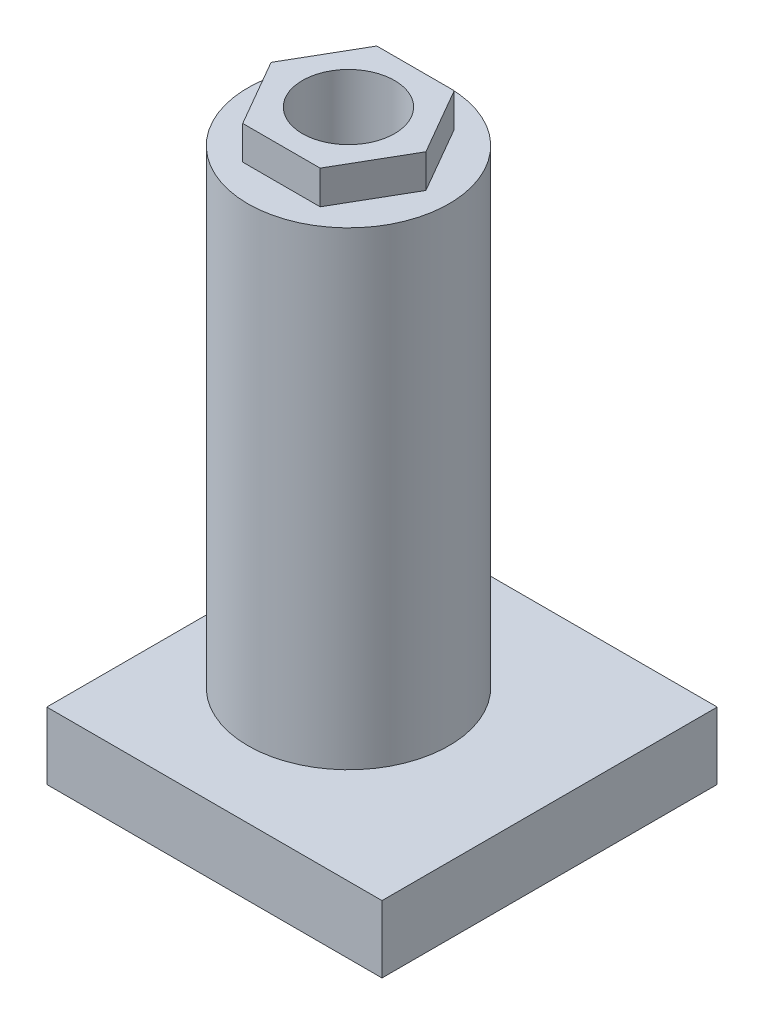
ISO-10303-21;
HEADER;
FILE_DESCRIPTION(('STEP AP214'),'2;1');
FILE_NAME('part.step','',(''),(''),'','','');
FILE_SCHEMA(('AUTOMOTIVE_DESIGN { 1 0 10303 214 1 1 1 1 }'));
ENDSEC;
DATA;
#1=APPLICATION_CONTEXT('core data for automotive mechanical design processes');
#2=APPLICATION_PROTOCOL_DEFINITION('international standard','automotive_design',2000,#1);
#3=PRODUCT_CONTEXT('',#1,'mechanical');
#4=PRODUCT('Part','Part','',(#3));
#5=PRODUCT_RELATED_PRODUCT_CATEGORY('part','',(#4));
#6=PRODUCT_DEFINITION_FORMATION('','',#4);
#7=PRODUCT_DEFINITION_CONTEXT('part definition',#1,'design');
#8=PRODUCT_DEFINITION('design','',#6,#7);
#9=PRODUCT_DEFINITION_SHAPE('','',#8);
#10=(LENGTH_UNIT() NAMED_UNIT(*) SI_UNIT(.MILLI.,.METRE.));
#11=(NAMED_UNIT(*) PLANE_ANGLE_UNIT() SI_UNIT($,.RADIAN.));
#12=(NAMED_UNIT(*) SI_UNIT($,.STERADIAN.) SOLID_ANGLE_UNIT());
#13=UNCERTAINTY_MEASURE_WITH_UNIT(LENGTH_MEASURE(1.E-05),#10,'distance_accuracy_value','');
#14=(GEOMETRIC_REPRESENTATION_CONTEXT(3) GLOBAL_UNCERTAINTY_ASSIGNED_CONTEXT((#13)) GLOBAL_UNIT_ASSIGNED_CONTEXT((#10,
#11,#12)) REPRESENTATION_CONTEXT('',''));
#15=CARTESIAN_POINT('',(0.,0.,0.));
#16=DIRECTION('',(0.,0.,1.));
#17=DIRECTION('',(1.,0.,0.));
#18=AXIS2_PLACEMENT_3D('',#15,#16,#17);
#19=CARTESIAN_POINT('',(-12.7,203.2,0.));
#20=DIRECTION('',(0.,1.,0.));
#21=DIRECTION('',(0.,0.,1.));
#22=AXIS2_PLACEMENT_3D('',#19,#20,#21);
#23=PLANE('',#22);
#24=CARTESIAN_POINT('',(-12.7,203.2,0.));
#25=DIRECTION('',(0.,1.,0.));
#26=DIRECTION('',(0.,0.,1.));
#27=AXIS2_PLACEMENT_3D('',#24,#25,#26);
#28=CIRCLE('',#27,38.1);
#29=CARTESIAN_POINT('',(-12.7,203.2,38.1));
#30=VERTEX_POINT('',#29);
#31=EDGE_CURVE('E147',#30,#30,#28,.T.);
#32=ORIENTED_EDGE('',*,*,#31,.T.);
#33=EDGE_LOOP('',(#32));
#34=FACE_BOUND('',#33,.T.);
#35=DIRECTION('',(-0.5,0.,-0.866025403784438));
#36=VECTOR('',#35,1.);
#37=CARTESIAN_POINT('',(16.629393674833,203.2,0.));
#38=LINE('',#37,#36);
#39=CARTESIAN_POINT('',(16.629393674833,203.2,0.));
#40=VERTEX_POINT('',#39);
#41=CARTESIAN_POINT('',(1.96469683741646,203.2,-25.4));
#42=VERTEX_POINT('',#41);
#43=EDGE_CURVE('E254',#40,#42,#38,.T.);
#44=ORIENTED_EDGE('',*,*,#43,.F.);
#45=DIRECTION('',(0.5,0.,-0.866025403784439));
#46=VECTOR('',#45,1.);
#47=CARTESIAN_POINT('',(1.96469683741646,203.2,25.4));
#48=LINE('',#47,#46);
#49=CARTESIAN_POINT('',(1.96469683741646,203.2,25.4));
#50=VERTEX_POINT('',#49);
#51=EDGE_CURVE('E142',#50,#40,#48,.T.);
#52=ORIENTED_EDGE('',*,*,#51,.F.);
#53=DIRECTION('',(1.,0.,0.));
#54=VECTOR('',#53,1.);
#55=CARTESIAN_POINT('',(-27.3646968374165,203.2,25.4));
#56=LINE('',#55,#54);
#57=CARTESIAN_POINT('',(-27.3646968374165,203.2,25.4));
#58=VERTEX_POINT('',#57);
#59=EDGE_CURVE('E138',#58,#50,#56,.T.);
#60=ORIENTED_EDGE('',*,*,#59,.F.);
#61=DIRECTION('',(0.5,0.,0.866025403784438));
#62=VECTOR('',#61,1.);
#63=CARTESIAN_POINT('',(-42.029393674833,203.2,0.));
#64=LINE('',#63,#62);
#65=CARTESIAN_POINT('',(-42.029393674833,203.2,0.));
#66=VERTEX_POINT('',#65);
#67=EDGE_CURVE('E271',#66,#58,#64,.T.);
#68=ORIENTED_EDGE('',*,*,#67,.F.);
#69=DIRECTION('',(-0.5,0.,0.866025403784439));
#70=VECTOR('',#69,1.);
#71=CARTESIAN_POINT('',(-27.3646968374165,203.2,-25.4));
#72=LINE('',#71,#70);
#73=CARTESIAN_POINT('',(-27.3646968374165,203.2,-25.4));
#74=VERTEX_POINT('',#73);
#75=EDGE_CURVE('E269',#74,#66,#72,.T.);
#76=ORIENTED_EDGE('',*,*,#75,.F.);
#77=DIRECTION('',(-1.,0.,0.));
#78=VECTOR('',#77,1.);
#79=CARTESIAN_POINT('',(1.96469683741646,203.2,-25.4));
#80=LINE('',#79,#78);
#81=EDGE_CURVE('E267',#42,#74,#80,.T.);
#82=ORIENTED_EDGE('',*,*,#81,.F.);
#83=EDGE_LOOP('',(#44,#52,#60,#68,#76,#82));
#84=FACE_BOUND('',#83,.T.);
#85=ADVANCED_FACE('F33',(#34,#84),#23,.T.);
#86=CARTESIAN_POINT('',(0.,25.4,0.));
#87=DIRECTION('',(0.,1.,0.));
#88=DIRECTION('',(0.,0.,1.));
#89=AXIS2_PLACEMENT_3D('',#86,#87,#88);
#90=PLANE('',#89);
#91=DIRECTION('',(0.,0.,-1.));
#92=VECTOR('',#91,1.);
#93=CARTESIAN_POINT('',(63.5,25.4,-63.5));
#94=LINE('',#93,#92);
#95=CARTESIAN_POINT('',(63.5,25.4,63.5));
#96=VERTEX_POINT('',#95);
#97=CARTESIAN_POINT('',(63.5,25.4,-63.5));
#98=VERTEX_POINT('',#97);
#99=EDGE_CURVE('E156',#96,#98,#94,.T.);
#100=ORIENTED_EDGE('',*,*,#99,.T.);
#101=DIRECTION('',(-1.,0.,0.));
#102=VECTOR('',#101,1.);
#103=CARTESIAN_POINT('',(-63.5,25.4,-63.5));
#104=LINE('',#103,#102);
#105=CARTESIAN_POINT('',(-63.5,25.4,-63.5));
#106=VERTEX_POINT('',#105);
#107=EDGE_CURVE('E85',#98,#106,#104,.T.);
#108=ORIENTED_EDGE('',*,*,#107,.T.);
#109=DIRECTION('',(0.,0.,1.));
#110=VECTOR('',#109,1.);
#111=CARTESIAN_POINT('',(-63.5,25.4,-63.5));
#112=LINE('',#111,#110);
#113=CARTESIAN_POINT('',(-63.5,25.4,63.5));
#114=VERTEX_POINT('',#113);
#115=EDGE_CURVE('E159',#106,#114,#112,.T.);
#116=ORIENTED_EDGE('',*,*,#115,.T.);
#117=DIRECTION('',(1.,0.,0.));
#118=VECTOR('',#117,1.);
#119=CARTESIAN_POINT('',(-63.5,25.4,63.5));
#120=LINE('',#119,#118);
#121=EDGE_CURVE('E57',#114,#96,#120,.T.);
#122=ORIENTED_EDGE('',*,*,#121,.T.);
#123=EDGE_LOOP('',(#100,#108,#116,#122));
#124=FACE_BOUND('',#123,.T.);
#125=CARTESIAN_POINT('',(-12.7,25.4,0.));
#126=DIRECTION('',(0.,1.,0.));
#127=DIRECTION('',(0.,0.,1.));
#128=AXIS2_PLACEMENT_3D('',#125,#126,#127);
#129=CIRCLE('',#128,38.1);
#130=CARTESIAN_POINT('',(-12.7,25.4,38.1));
#131=VERTEX_POINT('',#130);
#132=EDGE_CURVE('E144',#131,#131,#129,.T.);
#133=ORIENTED_EDGE('',*,*,#132,.F.);
#134=EDGE_LOOP('',(#133));
#135=FACE_BOUND('',#134,.T.);
#136=ADVANCED_FACE('F196',(#124,#135),#90,.T.);
#137=CARTESIAN_POINT('',(63.5,25.4,-63.5));
#138=DIRECTION('',(-1.,0.,0.));
#139=DIRECTION('',(0.,0.,1.));
#140=AXIS2_PLACEMENT_3D('',#137,#138,#139);
#141=PLANE('',#140);
#142=DIRECTION('',(0.,0.,-1.));
#143=VECTOR('',#142,1.);
#144=CARTESIAN_POINT('',(63.5,0.,-63.5));
#145=LINE('',#144,#143);
#146=CARTESIAN_POINT('',(63.5,0.,63.5));
#147=VERTEX_POINT('',#146);
#148=CARTESIAN_POINT('',(63.5,0.,-63.5));
#149=VERTEX_POINT('',#148);
#150=EDGE_CURVE('E154',#147,#149,#145,.T.);
#151=ORIENTED_EDGE('',*,*,#150,.T.);
#152=DIRECTION('',(0.,-1.,0.));
#153=VECTOR('',#152,1.);
#154=CARTESIAN_POINT('',(63.5,25.4,-63.5));
#155=LINE('',#154,#153);
#156=EDGE_CURVE('E11',#98,#149,#155,.T.);
#157=ORIENTED_EDGE('',*,*,#156,.F.);
#158=ORIENTED_EDGE('',*,*,#99,.F.);
#159=DIRECTION('',(0.,-1.,0.));
#160=VECTOR('',#159,1.);
#161=CARTESIAN_POINT('',(63.5,25.4,63.5));
#162=LINE('',#161,#160);
#163=EDGE_CURVE('E162',#96,#147,#162,.T.);
#164=ORIENTED_EDGE('',*,*,#163,.T.);
#165=EDGE_LOOP('',(#151,#157,#158,#164));
#166=FACE_BOUND('',#165,.T.);
#167=ADVANCED_FACE('F35',(#166),#141,.F.);
#168=CARTESIAN_POINT('',(-63.5,25.4,-63.5));
#169=DIRECTION('',(0.,0.,1.));
#170=DIRECTION('',(1.,0.,0.));
#171=AXIS2_PLACEMENT_3D('',#168,#169,#170);
#172=PLANE('',#171);
#173=DIRECTION('',(-1.,0.,0.));
#174=VECTOR('',#173,1.);
#175=CARTESIAN_POINT('',(-63.5,0.,-63.5));
#176=LINE('',#175,#174);
#177=CARTESIAN_POINT('',(-63.5,0.,-63.5));
#178=VERTEX_POINT('',#177);
#179=EDGE_CURVE('E165',#149,#178,#176,.T.);
#180=ORIENTED_EDGE('',*,*,#179,.T.);
#181=DIRECTION('',(0.,-1.,0.));
#182=VECTOR('',#181,1.);
#183=CARTESIAN_POINT('',(-63.5,25.4,-63.5));
#184=LINE('',#183,#182);
#185=EDGE_CURVE('E41',#106,#178,#184,.T.);
#186=ORIENTED_EDGE('',*,*,#185,.F.);
#187=ORIENTED_EDGE('',*,*,#107,.F.);
#188=ORIENTED_EDGE('',*,*,#156,.T.);
#189=EDGE_LOOP('',(#180,#186,#187,#188));
#190=FACE_BOUND('',#189,.T.);
#191=ADVANCED_FACE('F193',(#190),#172,.F.);
#192=CARTESIAN_POINT('',(-63.5,25.4,-63.5));
#193=DIRECTION('',(1.,0.,0.));
#194=DIRECTION('',(0.,0.,-1.));
#195=AXIS2_PLACEMENT_3D('',#192,#193,#194);
#196=PLANE('',#195);
#197=DIRECTION('',(0.,0.,1.));
#198=VECTOR('',#197,1.);
#199=CARTESIAN_POINT('',(-63.5,0.,-63.5));
#200=LINE('',#199,#198);
#201=CARTESIAN_POINT('',(-63.5,0.,63.5));
#202=VERTEX_POINT('',#201);
#203=EDGE_CURVE('E167',#178,#202,#200,.T.);
#204=ORIENTED_EDGE('',*,*,#203,.T.);
#205=DIRECTION('',(0.,-1.,0.));
#206=VECTOR('',#205,1.);
#207=CARTESIAN_POINT('',(-63.5,25.4,63.5));
#208=LINE('',#207,#206);
#209=EDGE_CURVE('E171',#114,#202,#208,.T.);
#210=ORIENTED_EDGE('',*,*,#209,.F.);
#211=ORIENTED_EDGE('',*,*,#115,.F.);
#212=ORIENTED_EDGE('',*,*,#185,.T.);
#213=EDGE_LOOP('',(#204,#210,#211,#212));
#214=FACE_BOUND('',#213,.T.);
#215=ADVANCED_FACE('F176',(#214),#196,.F.);
#216=CARTESIAN_POINT('',(-63.5,25.4,63.5));
#217=DIRECTION('',(0.,0.,-1.));
#218=DIRECTION('',(-1.,0.,0.));
#219=AXIS2_PLACEMENT_3D('',#216,#217,#218);
#220=PLANE('',#219);
#221=DIRECTION('',(1.,0.,0.));
#222=VECTOR('',#221,1.);
#223=CARTESIAN_POINT('',(-63.5,0.,63.5));
#224=LINE('',#223,#222);
#225=EDGE_CURVE('E78',#202,#147,#224,.T.);
#226=ORIENTED_EDGE('',*,*,#225,.T.);
#227=ORIENTED_EDGE('',*,*,#163,.F.);
#228=ORIENTED_EDGE('',*,*,#121,.F.);
#229=ORIENTED_EDGE('',*,*,#209,.T.);
#230=EDGE_LOOP('',(#226,#227,#228,#229));
#231=FACE_BOUND('',#230,.T.);
#232=ADVANCED_FACE('F184',(#231),#220,.F.);
#233=CARTESIAN_POINT('',(0.,0.,0.));
#234=DIRECTION('',(0.,1.,0.));
#235=DIRECTION('',(0.,0.,1.));
#236=AXIS2_PLACEMENT_3D('',#233,#234,#235);
#237=PLANE('',#236);
#238=ORIENTED_EDGE('',*,*,#150,.F.);
#239=ORIENTED_EDGE('',*,*,#225,.F.);
#240=ORIENTED_EDGE('',*,*,#203,.F.);
#241=ORIENTED_EDGE('',*,*,#179,.F.);
#242=EDGE_LOOP('',(#238,#239,#240,#241));
#243=FACE_BOUND('',#242,.T.);
#244=ADVANCED_FACE('F180',(#243),#237,.F.);
#245=CARTESIAN_POINT('',(-12.7,203.2,0.));
#246=DIRECTION('',(0.,-1.,0.));
#247=DIRECTION('',(0.,0.,-1.));
#248=AXIS2_PLACEMENT_3D('',#245,#246,#247);
#249=CYLINDRICAL_SURFACE('',#248,38.1);
#250=ORIENTED_EDGE('',*,*,#31,.F.);
#251=EDGE_LOOP('',(#250));
#252=FACE_BOUND('',#251,.T.);
#253=ORIENTED_EDGE('',*,*,#132,.T.);
#254=EDGE_LOOP('',(#253));
#255=FACE_BOUND('',#254,.T.);
#256=ADVANCED_FACE('F191',(#252,#255),#249,.T.);
#257=CARTESIAN_POINT('',(1.96469683741646,215.9,25.4));
#258=DIRECTION('',(-0.866025403784439,0.,-0.5));
#259=DIRECTION('',(-0.5,0.,0.866025403784439));
#260=AXIS2_PLACEMENT_3D('',#257,#258,#259);
#261=PLANE('',#260);
#262=ORIENTED_EDGE('',*,*,#51,.T.);
#263=DIRECTION('',(0.,-1.,0.));
#264=VECTOR('',#263,1.);
#265=CARTESIAN_POINT('',(16.629393674833,215.9,0.));
#266=LINE('',#265,#264);
#267=CARTESIAN_POINT('',(16.629393674833,215.9,0.));
#268=VERTEX_POINT('',#267);
#269=EDGE_CURVE('E123',#268,#40,#266,.T.);
#270=ORIENTED_EDGE('',*,*,#269,.F.);
#271=DIRECTION('',(0.5,0.,-0.866025403784439));
#272=VECTOR('',#271,1.);
#273=CARTESIAN_POINT('',(1.96469683741646,215.9,25.4));
#274=LINE('',#273,#272);
#275=CARTESIAN_POINT('',(1.96469683741646,215.9,25.4));
#276=VERTEX_POINT('',#275);
#277=EDGE_CURVE('E130',#276,#268,#274,.T.);
#278=ORIENTED_EDGE('',*,*,#277,.F.);
#279=DIRECTION('',(0.,-1.,0.));
#280=VECTOR('',#279,1.);
#281=CARTESIAN_POINT('',(1.96469683741646,215.9,25.4));
#282=LINE('',#281,#280);
#283=EDGE_CURVE('E264',#276,#50,#282,.T.);
#284=ORIENTED_EDGE('',*,*,#283,.T.);
#285=EDGE_LOOP('',(#262,#270,#278,#284));
#286=FACE_BOUND('',#285,.T.);
#287=ADVANCED_FACE('F140',(#286),#261,.F.);
#288=CARTESIAN_POINT('',(16.629393674833,215.9,0.));
#289=DIRECTION('',(-0.866025403784438,0.,0.5));
#290=DIRECTION('',(0.5,0.,0.866025403784439));
#291=AXIS2_PLACEMENT_3D('',#288,#289,#290);
#292=PLANE('',#291);
#293=ORIENTED_EDGE('',*,*,#43,.T.);
#294=DIRECTION('',(0.,-1.,0.));
#295=VECTOR('',#294,1.);
#296=CARTESIAN_POINT('',(1.96469683741646,215.9,-25.4));
#297=LINE('',#296,#295);
#298=CARTESIAN_POINT('',(1.96469683741646,215.9,-25.4));
#299=VERTEX_POINT('',#298);
#300=EDGE_CURVE('E126',#299,#42,#297,.T.);
#301=ORIENTED_EDGE('',*,*,#300,.F.);
#302=DIRECTION('',(-0.5,0.,-0.866025403784438));
#303=VECTOR('',#302,1.);
#304=CARTESIAN_POINT('',(16.629393674833,215.9,0.));
#305=LINE('',#304,#303);
#306=EDGE_CURVE('E119',#268,#299,#305,.T.);
#307=ORIENTED_EDGE('',*,*,#306,.F.);
#308=ORIENTED_EDGE('',*,*,#269,.T.);
#309=EDGE_LOOP('',(#293,#301,#307,#308));
#310=FACE_BOUND('',#309,.T.);
#311=ADVANCED_FACE('F121',(#310),#292,.F.);
#312=CARTESIAN_POINT('',(1.96469683741646,215.9,-25.4));
#313=DIRECTION('',(0.,0.,1.));
#314=DIRECTION('',(1.,0.,0.));
#315=AXIS2_PLACEMENT_3D('',#312,#313,#314);
#316=PLANE('',#315);
#317=ORIENTED_EDGE('',*,*,#81,.T.);
#318=DIRECTION('',(0.,-1.,0.));
#319=VECTOR('',#318,1.);
#320=CARTESIAN_POINT('',(-27.3646968374165,215.9,-25.4));
#321=LINE('',#320,#319);
#322=CARTESIAN_POINT('',(-27.3646968374165,215.9,-25.4));
#323=VERTEX_POINT('',#322);
#324=EDGE_CURVE('E149',#323,#74,#321,.T.);
#325=ORIENTED_EDGE('',*,*,#324,.F.);
#326=DIRECTION('',(-1.,0.,0.));
#327=VECTOR('',#326,1.);
#328=CARTESIAN_POINT('',(1.96469683741646,215.9,-25.4));
#329=LINE('',#328,#327);
#330=EDGE_CURVE('E129',#299,#323,#329,.T.);
#331=ORIENTED_EDGE('',*,*,#330,.F.);
#332=ORIENTED_EDGE('',*,*,#300,.T.);
#333=EDGE_LOOP('',(#317,#325,#331,#332));
#334=FACE_BOUND('',#333,.T.);
#335=ADVANCED_FACE('F219',(#334),#316,.F.);
#336=CARTESIAN_POINT('',(-27.3646968374165,215.9,-25.4));
#337=DIRECTION('',(0.866025403784439,0.,0.5));
#338=DIRECTION('',(0.5,0.,-0.866025403784439));
#339=AXIS2_PLACEMENT_3D('',#336,#337,#338);
#340=PLANE('',#339);
#341=ORIENTED_EDGE('',*,*,#75,.T.);
#342=DIRECTION('',(0.,-1.,0.));
#343=VECTOR('',#342,1.);
#344=CARTESIAN_POINT('',(-42.029393674833,215.9,0.));
#345=LINE('',#344,#343);
#346=CARTESIAN_POINT('',(-42.029393674833,215.9,0.));
#347=VERTEX_POINT('',#346);
#348=EDGE_CURVE('E276',#347,#66,#345,.T.);
#349=ORIENTED_EDGE('',*,*,#348,.F.);
#350=DIRECTION('',(-0.5,0.,0.866025403784439));
#351=VECTOR('',#350,1.);
#352=CARTESIAN_POINT('',(-27.3646968374165,215.9,-25.4));
#353=LINE('',#352,#351);
#354=EDGE_CURVE('E260',#323,#347,#353,.T.);
#355=ORIENTED_EDGE('',*,*,#354,.F.);
#356=ORIENTED_EDGE('',*,*,#324,.T.);
#357=EDGE_LOOP('',(#341,#349,#355,#356));
#358=FACE_BOUND('',#357,.T.);
#359=ADVANCED_FACE('F223',(#358),#340,.F.);
#360=CARTESIAN_POINT('',(-42.029393674833,215.9,0.));
#361=DIRECTION('',(0.866025403784438,0.,-0.5));
#362=DIRECTION('',(-0.5,0.,-0.866025403784439));
#363=AXIS2_PLACEMENT_3D('',#360,#361,#362);
#364=PLANE('',#363);
#365=ORIENTED_EDGE('',*,*,#67,.T.);
#366=DIRECTION('',(0.,-1.,0.));
#367=VECTOR('',#366,1.);
#368=CARTESIAN_POINT('',(-27.3646968374165,215.9,25.4));
#369=LINE('',#368,#367);
#370=CARTESIAN_POINT('',(-27.3646968374165,215.9,25.4));
#371=VERTEX_POINT('',#370);
#372=EDGE_CURVE('E48',#371,#58,#369,.T.);
#373=ORIENTED_EDGE('',*,*,#372,.F.);
#374=DIRECTION('',(0.5,0.,0.866025403784438));
#375=VECTOR('',#374,1.);
#376=CARTESIAN_POINT('',(-42.029393674833,215.9,0.));
#377=LINE('',#376,#375);
#378=EDGE_CURVE('E262',#347,#371,#377,.T.);
#379=ORIENTED_EDGE('',*,*,#378,.F.);
#380=ORIENTED_EDGE('',*,*,#348,.T.);
#381=EDGE_LOOP('',(#365,#373,#379,#380));
#382=FACE_BOUND('',#381,.T.);
#383=ADVANCED_FACE('F229',(#382),#364,.F.);
#384=CARTESIAN_POINT('',(-27.3646968374165,215.9,25.4));
#385=DIRECTION('',(0.,0.,-1.));
#386=DIRECTION('',(-1.,0.,0.));
#387=AXIS2_PLACEMENT_3D('',#384,#385,#386);
#388=PLANE('',#387);
#389=ORIENTED_EDGE('',*,*,#59,.T.);
#390=ORIENTED_EDGE('',*,*,#283,.F.);
#391=DIRECTION('',(1.,0.,0.));
#392=VECTOR('',#391,1.);
#393=CARTESIAN_POINT('',(-27.3646968374165,215.9,25.4));
#394=LINE('',#393,#392);
#395=EDGE_CURVE('E134',#371,#276,#394,.T.);
#396=ORIENTED_EDGE('',*,*,#395,.F.);
#397=ORIENTED_EDGE('',*,*,#372,.T.);
#398=EDGE_LOOP('',(#389,#390,#396,#397));
#399=FACE_BOUND('',#398,.T.);
#400=ADVANCED_FACE('F233',(#399),#388,.F.);
#401=CARTESIAN_POINT('',(0.,215.9,0.));
#402=DIRECTION('',(0.,1.,0.));
#403=DIRECTION('',(0.,0.,1.));
#404=AXIS2_PLACEMENT_3D('',#401,#402,#403);
#405=PLANE('',#404);
#406=CARTESIAN_POINT('',(-12.7,215.9,0.));
#407=DIRECTION('',(0.,1.,0.));
#408=DIRECTION('',(0.,0.,1.));
#409=AXIS2_PLACEMENT_3D('',#406,#407,#408);
#410=CIRCLE('',#409,17.4625);
#411=CARTESIAN_POINT('',(-12.7,215.9,17.4625));
#412=VERTEX_POINT('',#411);
#413=EDGE_CURVE('E252',#412,#412,#410,.T.);
#414=ORIENTED_EDGE('',*,*,#413,.F.);
#415=EDGE_LOOP('',(#414));
#416=FACE_BOUND('',#415,.T.);
#417=ORIENTED_EDGE('',*,*,#277,.T.);
#418=ORIENTED_EDGE('',*,*,#306,.T.);
#419=ORIENTED_EDGE('',*,*,#330,.T.);
#420=ORIENTED_EDGE('',*,*,#354,.T.);
#421=ORIENTED_EDGE('',*,*,#378,.T.);
#422=ORIENTED_EDGE('',*,*,#395,.T.);
#423=EDGE_LOOP('',(#417,#418,#419,#420,#421,#422));
#424=FACE_BOUND('',#423,.T.);
#425=ADVANCED_FACE('F133',(#416,#424),#405,.T.);
#426=CARTESIAN_POINT('',(-12.7,63.5,0.));
#427=DIRECTION('',(0.,1.,0.));
#428=DIRECTION('',(0.,0.,1.));
#429=AXIS2_PLACEMENT_3D('',#426,#427,#428);
#430=CYLINDRICAL_SURFACE('',#429,17.4625);
#431=CARTESIAN_POINT('',(-12.7,63.5,0.));
#432=DIRECTION('',(0.,1.,0.));
#433=DIRECTION('',(0.,0.,1.));
#434=AXIS2_PLACEMENT_3D('',#431,#432,#433);
#435=CIRCLE('',#434,17.4625);
#436=CARTESIAN_POINT('',(-12.7,63.5,17.4625));
#437=VERTEX_POINT('',#436);
#438=EDGE_CURVE('E251',#437,#437,#435,.T.);
#439=ORIENTED_EDGE('',*,*,#438,.F.);
#440=EDGE_LOOP('',(#439));
#441=FACE_BOUND('',#440,.T.);
#442=ORIENTED_EDGE('',*,*,#413,.T.);
#443=EDGE_LOOP('',(#442));
#444=FACE_BOUND('',#443,.T.);
#445=ADVANCED_FACE('F239',(#441,#444),#430,.F.);
#446=CARTESIAN_POINT('',(-12.7,63.5,0.));
#447=DIRECTION('',(0.,1.,0.));
#448=DIRECTION('',(0.,0.,1.));
#449=AXIS2_PLACEMENT_3D('',#446,#447,#448);
#450=PLANE('',#449);
#451=ORIENTED_EDGE('',*,*,#438,.T.);
#452=EDGE_LOOP('',(#451));
#453=FACE_BOUND('',#452,.T.);
#454=ADVANCED_FACE('F243',(#453),#450,.T.);
#455=CLOSED_SHELL('',(#85,#136,#167,#191,#215,#232,#244,#256,#287,#311,#335,#359,#383,#400,#425,
#445,#454));
#456=MANIFOLD_SOLID_BREP('B2',#455);
#457=ADVANCED_BREP_SHAPE_REPRESENTATION('',(#18,#456),#14);
#458=SHAPE_DEFINITION_REPRESENTATION(#9,#457);
ENDSEC;
END-ISO-10303-21;
